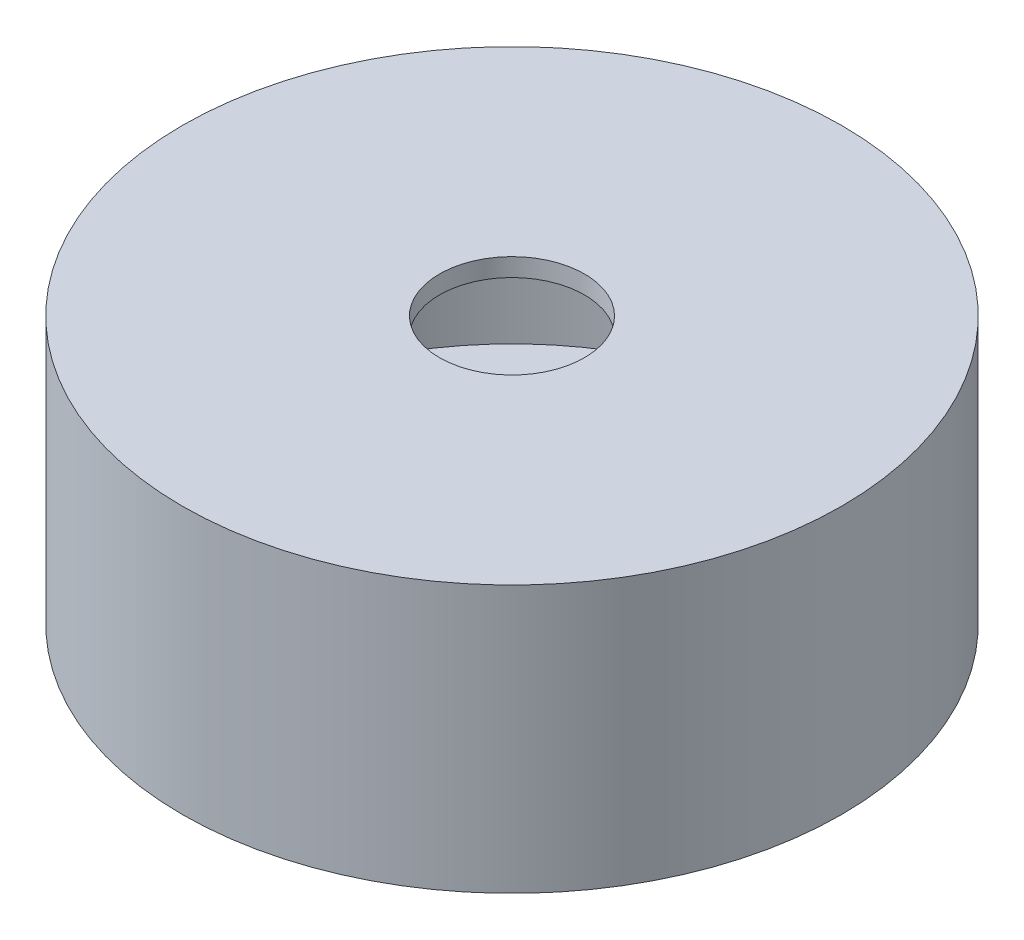
ISO-10303-21;
HEADER;
FILE_DESCRIPTION(('STEP AP214'),'2;1');
FILE_NAME('part.step','',(''),(''),'','','');
FILE_SCHEMA(('AUTOMOTIVE_DESIGN { 1 0 10303 214 1 1 1 1 }'));
ENDSEC;
DATA;
#1=APPLICATION_CONTEXT('core data for automotive mechanical design processes');
#2=APPLICATION_PROTOCOL_DEFINITION('international standard','automotive_design',2000,#1);
#3=PRODUCT_CONTEXT('',#1,'mechanical');
#4=PRODUCT('Part','Part','',(#3));
#5=PRODUCT_RELATED_PRODUCT_CATEGORY('part','',(#4));
#6=PRODUCT_DEFINITION_FORMATION('','',#4);
#7=PRODUCT_DEFINITION_CONTEXT('part definition',#1,'design');
#8=PRODUCT_DEFINITION('design','',#6,#7);
#9=PRODUCT_DEFINITION_SHAPE('','',#8);
#10=(LENGTH_UNIT() NAMED_UNIT(*) SI_UNIT(.MILLI.,.METRE.));
#11=(NAMED_UNIT(*) PLANE_ANGLE_UNIT() SI_UNIT($,.RADIAN.));
#12=(NAMED_UNIT(*) SI_UNIT($,.STERADIAN.) SOLID_ANGLE_UNIT());
#13=UNCERTAINTY_MEASURE_WITH_UNIT(LENGTH_MEASURE(1.E-05),#10,'distance_accuracy_value','');
#14=(GEOMETRIC_REPRESENTATION_CONTEXT(3) GLOBAL_UNCERTAINTY_ASSIGNED_CONTEXT((#13)) GLOBAL_UNIT_ASSIGNED_CONTEXT((#10,
#11,#12)) REPRESENTATION_CONTEXT('',''));
#15=CARTESIAN_POINT('',(0.,0.,0.));
#16=DIRECTION('',(0.,0.,1.));
#17=DIRECTION('',(1.,0.,0.));
#18=AXIS2_PLACEMENT_3D('',#15,#16,#17);
#19=CARTESIAN_POINT('',(50.,5.,0.));
#20=DIRECTION('',(-1.,0.,0.));
#21=DIRECTION('',(0.,0.,1.));
#22=AXIS2_PLACEMENT_3D('',#19,#20,#21);
#23=PLANE('',#22);
#24=DIRECTION('',(0.,0.,-1.));
#25=VECTOR('',#24,1.);
#26=CARTESIAN_POINT('',(50.,0.,0.));
#27=LINE('',#26,#25);
#28=CARTESIAN_POINT('',(50.,0.,-7.8));
#29=VERTEX_POINT('',#28);
#30=CARTESIAN_POINT('',(50.,0.,-32.2));
#31=VERTEX_POINT('',#30);
#32=EDGE_CURVE('E84',#29,#31,#27,.T.);
#33=ORIENTED_EDGE('',*,*,#32,.F.);
#34=DIRECTION('',(0.,-1.,0.));
#35=VECTOR('',#34,1.);
#36=CARTESIAN_POINT('',(50.,5.,-7.8));
#37=LINE('',#36,#35);
#38=CARTESIAN_POINT('',(50.,5.,-7.8));
#39=VERTEX_POINT('',#38);
#40=EDGE_CURVE('E11',#39,#29,#37,.T.);
#41=ORIENTED_EDGE('',*,*,#40,.F.);
#42=DIRECTION('',(0.,0.,-1.));
#43=VECTOR('',#42,1.);
#44=CARTESIAN_POINT('',(50.,5.,0.));
#45=LINE('',#44,#43);
#46=CARTESIAN_POINT('',(50.,5.,-32.2));
#47=VERTEX_POINT('',#46);
#48=EDGE_CURVE('E87',#39,#47,#45,.T.);
#49=ORIENTED_EDGE('',*,*,#48,.T.);
#50=DIRECTION('',(0.,-1.,0.));
#51=VECTOR('',#50,1.);
#52=CARTESIAN_POINT('',(50.,5.,-32.2));
#53=LINE('',#52,#51);
#54=EDGE_CURVE('E94',#47,#31,#53,.T.);
#55=ORIENTED_EDGE('',*,*,#54,.T.);
#56=EDGE_LOOP('',(#33,#41,#49,#55));
#57=FACE_BOUND('',#56,.T.);
#58=ADVANCED_FACE('F43',(#57),#23,.T.);
#59=CARTESIAN_POINT('',(0.,5.,-7.8));
#60=DIRECTION('',(0.,0.,-1.));
#61=DIRECTION('',(-1.,0.,0.));
#62=AXIS2_PLACEMENT_3D('',#59,#60,#61);
#63=PLANE('',#62);
#64=DIRECTION('',(1.,0.,0.));
#65=VECTOR('',#64,1.);
#66=CARTESIAN_POINT('',(0.,0.,-7.8));
#67=LINE('',#66,#65);
#68=CARTESIAN_POINT('',(5.,0.,-7.8));
#69=VERTEX_POINT('',#68);
#70=EDGE_CURVE('E98',#69,#29,#67,.T.);
#71=ORIENTED_EDGE('',*,*,#70,.F.);
#72=DIRECTION('',(0.,-1.,0.));
#73=VECTOR('',#72,1.);
#74=CARTESIAN_POINT('',(5.,5.,-7.8));
#75=LINE('',#74,#73);
#76=CARTESIAN_POINT('',(5.,5.,-7.8));
#77=VERTEX_POINT('',#76);
#78=EDGE_CURVE('E52',#77,#69,#75,.T.);
#79=ORIENTED_EDGE('',*,*,#78,.F.);
#80=DIRECTION('',(1.,0.,0.));
#81=VECTOR('',#80,1.);
#82=CARTESIAN_POINT('',(0.,5.,-7.8));
#83=LINE('',#82,#81);
#84=EDGE_CURVE('E108',#77,#39,#83,.T.);
#85=ORIENTED_EDGE('',*,*,#84,.T.);
#86=ORIENTED_EDGE('',*,*,#40,.T.);
#87=EDGE_LOOP('',(#71,#79,#85,#86));
#88=FACE_BOUND('',#87,.T.);
#89=ADVANCED_FACE('F136',(#88),#63,.T.);
#90=CARTESIAN_POINT('',(5.,5.,0.));
#91=DIRECTION('',(-1.,0.,0.));
#92=DIRECTION('',(0.,0.,1.));
#93=AXIS2_PLACEMENT_3D('',#90,#91,#92);
#94=PLANE('',#93);
#95=DIRECTION('',(0.,0.,-1.));
#96=VECTOR('',#95,1.);
#97=CARTESIAN_POINT('',(5.,0.,0.));
#98=LINE('',#97,#96);
#99=CARTESIAN_POINT('',(5.,0.,-32.2));
#100=VERTEX_POINT('',#99);
#101=EDGE_CURVE('E81',#69,#100,#98,.T.);
#102=ORIENTED_EDGE('',*,*,#101,.T.);
#103=DIRECTION('',(0.,-1.,0.));
#104=VECTOR('',#103,1.);
#105=CARTESIAN_POINT('',(5.,5.,-32.2));
#106=LINE('',#105,#104);
#107=CARTESIAN_POINT('',(5.,5.,-32.2));
#108=VERTEX_POINT('',#107);
#109=EDGE_CURVE('E90',#108,#100,#106,.T.);
#110=ORIENTED_EDGE('',*,*,#109,.F.);
#111=DIRECTION('',(0.,0.,-1.));
#112=VECTOR('',#111,1.);
#113=CARTESIAN_POINT('',(5.,5.,0.));
#114=LINE('',#113,#112);
#115=EDGE_CURVE('E59',#77,#108,#114,.T.);
#116=ORIENTED_EDGE('',*,*,#115,.F.);
#117=ORIENTED_EDGE('',*,*,#78,.T.);
#118=EDGE_LOOP('',(#102,#110,#116,#117));
#119=FACE_BOUND('',#118,.T.);
#120=ADVANCED_FACE('F96',(#119),#94,.F.);
#121=CARTESIAN_POINT('',(17.,5.,-20.));
#122=DIRECTION('',(0.,-1.,0.));
#123=DIRECTION('',(0.,0.,-1.));
#124=AXIS2_PLACEMENT_3D('',#121,#122,#123);
#125=CYLINDRICAL_SURFACE('',#124,50.);
#126=CARTESIAN_POINT('',(17.,0.,-20.));
#127=DIRECTION('',(0.,1.,0.));
#128=DIRECTION('',(0.,0.,1.));
#129=AXIS2_PLACEMENT_3D('',#126,#127,#128);
#130=CIRCLE('',#129,50.);
#131=CARTESIAN_POINT('',(17.,0.,30.));
#132=VERTEX_POINT('',#131);
#133=EDGE_CURVE('E112',#132,#132,#130,.T.);
#134=ORIENTED_EDGE('',*,*,#133,.T.);
#135=EDGE_LOOP('',(#134));
#136=FACE_BOUND('',#135,.T.);
#137=CARTESIAN_POINT('',(17.,40.5,-20.));
#138=DIRECTION('',(0.,1.,0.));
#139=DIRECTION('',(0.,0.,1.));
#140=AXIS2_PLACEMENT_3D('',#137,#138,#139);
#141=CIRCLE('',#140,50.);
#142=CARTESIAN_POINT('',(17.,40.5,30.));
#143=VERTEX_POINT('',#142);
#144=EDGE_CURVE('E214',#143,#143,#141,.T.);
#145=ORIENTED_EDGE('',*,*,#144,.F.);
#146=EDGE_LOOP('',(#145));
#147=FACE_BOUND('',#146,.T.);
#148=ADVANCED_FACE('F45',(#136,#147),#125,.T.);
#149=CARTESIAN_POINT('',(0.,5.,-32.2));
#150=DIRECTION('',(0.,0.,-1.));
#151=DIRECTION('',(-1.,0.,0.));
#152=AXIS2_PLACEMENT_3D('',#149,#150,#151);
#153=PLANE('',#152);
#154=DIRECTION('',(1.,0.,0.));
#155=VECTOR('',#154,1.);
#156=CARTESIAN_POINT('',(0.,0.,-32.2));
#157=LINE('',#156,#155);
#158=EDGE_CURVE('E76',#100,#31,#157,.T.);
#159=ORIENTED_EDGE('',*,*,#158,.T.);
#160=ORIENTED_EDGE('',*,*,#54,.F.);
#161=DIRECTION('',(1.,0.,0.));
#162=VECTOR('',#161,1.);
#163=CARTESIAN_POINT('',(0.,5.,-32.2));
#164=LINE('',#163,#162);
#165=EDGE_CURVE('E92',#108,#47,#164,.T.);
#166=ORIENTED_EDGE('',*,*,#165,.F.);
#167=ORIENTED_EDGE('',*,*,#109,.T.);
#168=EDGE_LOOP('',(#159,#160,#166,#167));
#169=FACE_BOUND('',#168,.T.);
#170=ADVANCED_FACE('F91',(#169),#153,.F.);
#171=CARTESIAN_POINT('',(0.,0.,0.));
#172=DIRECTION('',(0.,1.,0.));
#173=DIRECTION('',(0.,0.,1.));
#174=AXIS2_PLACEMENT_3D('',#171,#172,#173);
#175=PLANE('',#174);
#176=CARTESIAN_POINT('',(46.4999999999832,0.,-34.9999999999978));
#177=DIRECTION('',(0.,-1.,0.));
#178=DIRECTION('',(0.,0.,-1.));
#179=AXIS2_PLACEMENT_3D('',#176,#177,#178);
#180=CIRCLE('',#179,1.025);
#181=CARTESIAN_POINT('',(46.4999999999832,0.,-36.0249999999978));
#182=VERTEX_POINT('',#181);
#183=EDGE_CURVE('E118',#182,#182,#180,.T.);
#184=ORIENTED_EDGE('',*,*,#183,.F.);
#185=EDGE_LOOP('',(#184));
#186=FACE_BOUND('',#185,.T.);
#187=CARTESIAN_POINT('',(29.4999999999832,0.,-34.9999999999968));
#188=DIRECTION('',(0.,-1.,0.));
#189=DIRECTION('',(0.,0.,-1.));
#190=AXIS2_PLACEMENT_3D('',#187,#188,#189);
#191=CIRCLE('',#190,1.025);
#192=CARTESIAN_POINT('',(29.4999999999832,0.,-36.0249999999968));
#193=VERTEX_POINT('',#192);
#194=EDGE_CURVE('E123',#193,#193,#191,.T.);
#195=ORIENTED_EDGE('',*,*,#194,.F.);
#196=EDGE_LOOP('',(#195));
#197=FACE_BOUND('',#196,.T.);
#198=CARTESIAN_POINT('',(12.4999999999832,0.,-34.9999999999959));
#199=DIRECTION('',(0.,-1.,0.));
#200=DIRECTION('',(0.,0.,-1.));
#201=AXIS2_PLACEMENT_3D('',#198,#199,#200);
#202=CIRCLE('',#201,1.02499999999999);
#203=CARTESIAN_POINT('',(12.4999999999832,0.,-36.0249999999959));
#204=VERTEX_POINT('',#203);
#205=EDGE_CURVE('E248',#204,#204,#202,.T.);
#206=ORIENTED_EDGE('',*,*,#205,.F.);
#207=EDGE_LOOP('',(#206));
#208=FACE_BOUND('',#207,.T.);
#209=CARTESIAN_POINT('',(12.4999999999832,0.,-5.00000000000412));
#210=DIRECTION('',(0.,-1.,0.));
#211=DIRECTION('',(0.,0.,1.));
#212=AXIS2_PLACEMENT_3D('',#209,#210,#211);
#213=CIRCLE('',#212,1.02499999999999);
#214=CARTESIAN_POINT('',(12.4999999999832,0.,-3.97500000000413));
#215=VERTEX_POINT('',#214);
#216=EDGE_CURVE('E229',#215,#215,#213,.T.);
#217=ORIENTED_EDGE('',*,*,#216,.F.);
#218=EDGE_LOOP('',(#217));
#219=FACE_BOUND('',#218,.T.);
#220=CARTESIAN_POINT('',(29.4999999999832,0.,-5.00000000000318));
#221=DIRECTION('',(0.,-1.,0.));
#222=DIRECTION('',(0.,0.,1.));
#223=AXIS2_PLACEMENT_3D('',#220,#221,#222);
#224=CIRCLE('',#223,1.025);
#225=CARTESIAN_POINT('',(29.4999999999832,0.,-3.97500000000318));
#226=VERTEX_POINT('',#225);
#227=EDGE_CURVE('E226',#226,#226,#224,.T.);
#228=ORIENTED_EDGE('',*,*,#227,.F.);
#229=EDGE_LOOP('',(#228));
#230=FACE_BOUND('',#229,.T.);
#231=CARTESIAN_POINT('',(46.4999999999832,0.,-5.00000000000222));
#232=DIRECTION('',(0.,-1.,0.));
#233=DIRECTION('',(0.,0.,1.));
#234=AXIS2_PLACEMENT_3D('',#231,#232,#233);
#235=CIRCLE('',#234,1.025);
#236=CARTESIAN_POINT('',(46.4999999999832,0.,-3.97500000000222));
#237=VERTEX_POINT('',#236);
#238=EDGE_CURVE('E230',#237,#237,#235,.T.);
#239=ORIENTED_EDGE('',*,*,#238,.F.);
#240=EDGE_LOOP('',(#239));
#241=FACE_BOUND('',#240,.T.);
#242=CARTESIAN_POINT('',(52.7999999999835,0.,-11.5000000000019));
#243=DIRECTION('',(0.,-1.,0.));
#244=DIRECTION('',(0.,0.,1.));
#245=AXIS2_PLACEMENT_3D('',#242,#243,#244);
#246=CIRCLE('',#245,1.025);
#247=CARTESIAN_POINT('',(52.7999999999835,0.,-10.4750000000019));
#248=VERTEX_POINT('',#247);
#249=EDGE_CURVE('E132',#248,#248,#246,.T.);
#250=ORIENTED_EDGE('',*,*,#249,.F.);
#251=EDGE_LOOP('',(#250));
#252=FACE_BOUND('',#251,.T.);
#253=CARTESIAN_POINT('',(52.7999999999835,0.,-28.4999999999981));
#254=DIRECTION('',(0.,-1.,0.));
#255=DIRECTION('',(0.,0.,-1.));
#256=AXIS2_PLACEMENT_3D('',#253,#254,#255);
#257=CIRCLE('',#256,1.025);
#258=CARTESIAN_POINT('',(52.7999999999835,0.,-29.5249999999981));
#259=VERTEX_POINT('',#258);
#260=EDGE_CURVE('E114',#259,#259,#257,.T.);
#261=ORIENTED_EDGE('',*,*,#260,.F.);
#262=EDGE_LOOP('',(#261));
#263=FACE_BOUND('',#262,.T.);
#264=ORIENTED_EDGE('',*,*,#133,.F.);
#265=EDGE_LOOP('',(#264));
#266=FACE_BOUND('',#265,.T.);
#267=ORIENTED_EDGE('',*,*,#32,.T.);
#268=ORIENTED_EDGE('',*,*,#158,.F.);
#269=ORIENTED_EDGE('',*,*,#101,.F.);
#270=ORIENTED_EDGE('',*,*,#70,.T.);
#271=EDGE_LOOP('',(#267,#268,#269,#270));
#272=FACE_BOUND('',#271,.T.);
#273=ADVANCED_FACE('F78',(#186,#197,#208,#219,#230,#241,#252,#263,#266,#272),#175,.F.);
#274=CARTESIAN_POINT('',(52.7999999999835,5.001,-28.4999999999981));
#275=DIRECTION('',(0.,-1.,0.));
#276=DIRECTION('',(0.,0.,-1.));
#277=AXIS2_PLACEMENT_3D('',#274,#275,#276);
#278=CYLINDRICAL_SURFACE('',#277,1.025);
#279=CARTESIAN_POINT('',(52.7999999999835,5.,-28.4999999999981));
#280=DIRECTION('',(0.,1.,0.));
#281=DIRECTION('',(0.,0.,1.));
#282=AXIS2_PLACEMENT_3D('',#279,#280,#281);
#283=CIRCLE('',#282,1.025);
#284=CARTESIAN_POINT('',(52.7999999999835,5.,-27.4749999999981));
#285=VERTEX_POINT('',#284);
#286=EDGE_CURVE('E129',#285,#285,#283,.F.);
#287=ORIENTED_EDGE('',*,*,#286,.F.);
#288=EDGE_LOOP('',(#287));
#289=FACE_BOUND('',#288,.T.);
#290=ORIENTED_EDGE('',*,*,#260,.T.);
#291=EDGE_LOOP('',(#290));
#292=FACE_BOUND('',#291,.T.);
#293=ADVANCED_FACE('F154',(#289,#292),#278,.F.);
#294=CARTESIAN_POINT('',(52.7999999999835,5.001,-11.5000000000019));
#295=DIRECTION('',(0.,-1.,0.));
#296=DIRECTION('',(0.,0.,-1.));
#297=AXIS2_PLACEMENT_3D('',#294,#295,#296);
#298=CYLINDRICAL_SURFACE('',#297,1.025);
#299=CARTESIAN_POINT('',(52.7999999999835,5.,-11.5000000000019));
#300=DIRECTION('',(0.,1.,0.));
#301=DIRECTION('',(0.,0.,1.));
#302=AXIS2_PLACEMENT_3D('',#299,#300,#301);
#303=CIRCLE('',#302,1.025);
#304=CARTESIAN_POINT('',(52.7999999999835,5.,-10.4750000000019));
#305=VERTEX_POINT('',#304);
#306=EDGE_CURVE('E133',#305,#305,#303,.F.);
#307=ORIENTED_EDGE('',*,*,#306,.F.);
#308=EDGE_LOOP('',(#307));
#309=FACE_BOUND('',#308,.T.);
#310=ORIENTED_EDGE('',*,*,#249,.T.);
#311=EDGE_LOOP('',(#310));
#312=FACE_BOUND('',#311,.T.);
#313=ADVANCED_FACE('F158',(#309,#312),#298,.F.);
#314=CARTESIAN_POINT('',(46.4999999999832,5.001,-5.00000000000222));
#315=DIRECTION('',(0.,-1.,0.));
#316=DIRECTION('',(0.,0.,-1.));
#317=AXIS2_PLACEMENT_3D('',#314,#315,#316);
#318=CYLINDRICAL_SURFACE('',#317,1.025);
#319=CARTESIAN_POINT('',(46.4999999999832,5.,-5.00000000000222));
#320=DIRECTION('',(0.,1.,0.));
#321=DIRECTION('',(0.,0.,1.));
#322=AXIS2_PLACEMENT_3D('',#319,#320,#321);
#323=CIRCLE('',#322,1.025);
#324=CARTESIAN_POINT('',(46.4999999999832,5.,-3.97500000000222));
#325=VERTEX_POINT('',#324);
#326=EDGE_CURVE('E234',#325,#325,#323,.F.);
#327=ORIENTED_EDGE('',*,*,#326,.F.);
#328=EDGE_LOOP('',(#327));
#329=FACE_BOUND('',#328,.T.);
#330=ORIENTED_EDGE('',*,*,#238,.T.);
#331=EDGE_LOOP('',(#330));
#332=FACE_BOUND('',#331,.T.);
#333=ADVANCED_FACE('F179',(#329,#332),#318,.F.);
#334=CARTESIAN_POINT('',(29.4999999999832,5.001,-5.00000000000318));
#335=DIRECTION('',(0.,-1.,0.));
#336=DIRECTION('',(0.,0.,-1.));
#337=AXIS2_PLACEMENT_3D('',#334,#335,#336);
#338=CYLINDRICAL_SURFACE('',#337,1.025);
#339=CARTESIAN_POINT('',(29.4999999999832,5.,-5.00000000000318));
#340=DIRECTION('',(0.,1.,0.));
#341=DIRECTION('',(0.,0.,1.));
#342=AXIS2_PLACEMENT_3D('',#339,#340,#341);
#343=CIRCLE('',#342,1.025);
#344=CARTESIAN_POINT('',(29.4999999999832,5.,-3.97500000000318));
#345=VERTEX_POINT('',#344);
#346=EDGE_CURVE('E231',#345,#345,#343,.F.);
#347=ORIENTED_EDGE('',*,*,#346,.F.);
#348=EDGE_LOOP('',(#347));
#349=FACE_BOUND('',#348,.T.);
#350=ORIENTED_EDGE('',*,*,#227,.T.);
#351=EDGE_LOOP('',(#350));
#352=FACE_BOUND('',#351,.T.);
#353=ADVANCED_FACE('F164',(#349,#352),#338,.F.);
#354=CARTESIAN_POINT('',(12.4999999999832,5.001,-5.00000000000412));
#355=DIRECTION('',(0.,-1.,0.));
#356=DIRECTION('',(0.,0.,-1.));
#357=AXIS2_PLACEMENT_3D('',#354,#355,#356);
#358=CYLINDRICAL_SURFACE('',#357,1.02499999999999);
#359=CARTESIAN_POINT('',(12.4999999999832,5.,-5.00000000000412));
#360=DIRECTION('',(0.,1.,0.));
#361=DIRECTION('',(0.,0.,1.));
#362=AXIS2_PLACEMENT_3D('',#359,#360,#361);
#363=CIRCLE('',#362,1.02499999999999);
#364=CARTESIAN_POINT('',(12.4999999999832,5.,-3.97500000000413));
#365=VERTEX_POINT('',#364);
#366=EDGE_CURVE('E127',#365,#365,#363,.F.);
#367=ORIENTED_EDGE('',*,*,#366,.F.);
#368=EDGE_LOOP('',(#367));
#369=FACE_BOUND('',#368,.T.);
#370=ORIENTED_EDGE('',*,*,#216,.T.);
#371=EDGE_LOOP('',(#370));
#372=FACE_BOUND('',#371,.T.);
#373=ADVANCED_FACE('F160',(#369,#372),#358,.F.);
#374=CARTESIAN_POINT('',(12.4999999999832,5.001,-34.9999999999959));
#375=DIRECTION('',(0.,-1.,0.));
#376=DIRECTION('',(0.,0.,-1.));
#377=AXIS2_PLACEMENT_3D('',#374,#375,#376);
#378=CYLINDRICAL_SURFACE('',#377,1.02499999999999);
#379=CARTESIAN_POINT('',(12.4999999999832,5.,-34.9999999999959));
#380=DIRECTION('',(0.,1.,0.));
#381=DIRECTION('',(0.,0.,1.));
#382=AXIS2_PLACEMENT_3D('',#379,#380,#381);
#383=CIRCLE('',#382,1.02499999999999);
#384=CARTESIAN_POINT('',(12.4999999999832,5.,-33.9749999999959));
#385=VERTEX_POINT('',#384);
#386=EDGE_CURVE('E251',#385,#385,#383,.F.);
#387=ORIENTED_EDGE('',*,*,#386,.F.);
#388=EDGE_LOOP('',(#387));
#389=FACE_BOUND('',#388,.T.);
#390=ORIENTED_EDGE('',*,*,#205,.T.);
#391=EDGE_LOOP('',(#390));
#392=FACE_BOUND('',#391,.T.);
#393=ADVANCED_FACE('F163',(#389,#392),#378,.F.);
#394=CARTESIAN_POINT('',(29.4999999999832,5.001,-34.9999999999968));
#395=DIRECTION('',(0.,-1.,0.));
#396=DIRECTION('',(0.,0.,-1.));
#397=AXIS2_PLACEMENT_3D('',#394,#395,#396);
#398=CYLINDRICAL_SURFACE('',#397,1.025);
#399=CARTESIAN_POINT('',(29.4999999999832,5.,-34.9999999999968));
#400=DIRECTION('',(0.,1.,0.));
#401=DIRECTION('',(0.,0.,1.));
#402=AXIS2_PLACEMENT_3D('',#399,#400,#401);
#403=CIRCLE('',#402,1.025);
#404=CARTESIAN_POINT('',(29.4999999999832,5.,-33.9749999999968));
#405=VERTEX_POINT('',#404);
#406=EDGE_CURVE('E245',#405,#405,#403,.F.);
#407=ORIENTED_EDGE('',*,*,#406,.F.);
#408=EDGE_LOOP('',(#407));
#409=FACE_BOUND('',#408,.T.);
#410=ORIENTED_EDGE('',*,*,#194,.T.);
#411=EDGE_LOOP('',(#410));
#412=FACE_BOUND('',#411,.T.);
#413=ADVANCED_FACE('F168',(#409,#412),#398,.F.);
#414=CARTESIAN_POINT('',(46.4999999999832,5.001,-34.9999999999978));
#415=DIRECTION('',(0.,-1.,0.));
#416=DIRECTION('',(0.,0.,-1.));
#417=AXIS2_PLACEMENT_3D('',#414,#415,#416);
#418=CYLINDRICAL_SURFACE('',#417,1.025);
#419=CARTESIAN_POINT('',(46.4999999999832,5.,-34.9999999999978));
#420=DIRECTION('',(0.,1.,0.));
#421=DIRECTION('',(0.,0.,1.));
#422=AXIS2_PLACEMENT_3D('',#419,#420,#421);
#423=CIRCLE('',#422,1.025);
#424=CARTESIAN_POINT('',(46.4999999999832,5.,-33.9749999999978));
#425=VERTEX_POINT('',#424);
#426=EDGE_CURVE('E223',#425,#425,#423,.F.);
#427=ORIENTED_EDGE('',*,*,#426,.F.);
#428=EDGE_LOOP('',(#427));
#429=FACE_BOUND('',#428,.T.);
#430=ORIENTED_EDGE('',*,*,#183,.T.);
#431=EDGE_LOOP('',(#430));
#432=FACE_BOUND('',#431,.T.);
#433=ADVANCED_FACE('F172',(#429,#432),#418,.F.);
#434=CARTESIAN_POINT('',(17.,5.,-20.));
#435=DIRECTION('',(0.,1.,0.));
#436=DIRECTION('',(0.,0.,1.));
#437=AXIS2_PLACEMENT_3D('',#434,#435,#436);
#438=PLANE('',#437);
#439=ORIENTED_EDGE('',*,*,#84,.F.);
#440=ORIENTED_EDGE('',*,*,#115,.T.);
#441=ORIENTED_EDGE('',*,*,#165,.T.);
#442=ORIENTED_EDGE('',*,*,#48,.F.);
#443=EDGE_LOOP('',(#439,#440,#441,#442));
#444=FACE_BOUND('',#443,.T.);
#445=CARTESIAN_POINT('',(17.,5.,-20.));
#446=DIRECTION('',(0.,1.,0.));
#447=DIRECTION('',(0.,0.,1.));
#448=AXIS2_PLACEMENT_3D('',#445,#446,#447);
#449=CIRCLE('',#448,45.);
#450=CARTESIAN_POINT('',(17.,5.,25.));
#451=VERTEX_POINT('',#450);
#452=EDGE_CURVE('E220',#451,#451,#449,.T.);
#453=ORIENTED_EDGE('',*,*,#452,.T.);
#454=EDGE_LOOP('',(#453));
#455=FACE_BOUND('',#454,.T.);
#456=ORIENTED_EDGE('',*,*,#426,.T.);
#457=EDGE_LOOP('',(#456));
#458=FACE_BOUND('',#457,.T.);
#459=ORIENTED_EDGE('',*,*,#406,.T.);
#460=EDGE_LOOP('',(#459));
#461=FACE_BOUND('',#460,.T.);
#462=ORIENTED_EDGE('',*,*,#386,.T.);
#463=EDGE_LOOP('',(#462));
#464=FACE_BOUND('',#463,.T.);
#465=ORIENTED_EDGE('',*,*,#366,.T.);
#466=EDGE_LOOP('',(#465));
#467=FACE_BOUND('',#466,.T.);
#468=ORIENTED_EDGE('',*,*,#346,.T.);
#469=EDGE_LOOP('',(#468));
#470=FACE_BOUND('',#469,.T.);
#471=ORIENTED_EDGE('',*,*,#326,.T.);
#472=EDGE_LOOP('',(#471));
#473=FACE_BOUND('',#472,.T.);
#474=ORIENTED_EDGE('',*,*,#306,.T.);
#475=EDGE_LOOP('',(#474));
#476=FACE_BOUND('',#475,.T.);
#477=ORIENTED_EDGE('',*,*,#286,.T.);
#478=EDGE_LOOP('',(#477));
#479=FACE_BOUND('',#478,.T.);
#480=ADVANCED_FACE('F139',(#444,#455,#458,#461,#464,#467,#470,#473,#476,#479),#438,.T.);
#481=CARTESIAN_POINT('',(17.,5.,-20.));
#482=DIRECTION('',(0.,1.,0.));
#483=DIRECTION('',(0.,0.,1.));
#484=AXIS2_PLACEMENT_3D('',#481,#482,#483);
#485=CYLINDRICAL_SURFACE('',#484,45.);
#486=ORIENTED_EDGE('',*,*,#452,.F.);
#487=EDGE_LOOP('',(#486));
#488=FACE_BOUND('',#487,.T.);
#489=CARTESIAN_POINT('',(17.,37.75,-20.));
#490=DIRECTION('',(0.,1.,0.));
#491=DIRECTION('',(0.,0.,1.));
#492=AXIS2_PLACEMENT_3D('',#489,#490,#491);
#493=CIRCLE('',#492,45.);
#494=CARTESIAN_POINT('',(17.,37.75,25.));
#495=VERTEX_POINT('',#494);
#496=EDGE_CURVE('E219',#495,#495,#493,.T.);
#497=ORIENTED_EDGE('',*,*,#496,.T.);
#498=EDGE_LOOP('',(#497));
#499=FACE_BOUND('',#498,.T.);
#500=ADVANCED_FACE('F187',(#488,#499),#485,.F.);
#501=CARTESIAN_POINT('',(17.,37.75,-20.));
#502=DIRECTION('',(0.,1.,0.));
#503=DIRECTION('',(0.,0.,1.));
#504=AXIS2_PLACEMENT_3D('',#501,#502,#503);
#505=PLANE('',#504);
#506=CARTESIAN_POINT('',(17.,37.75,-20.));
#507=DIRECTION('',(0.,1.,0.));
#508=DIRECTION('',(0.,0.,1.));
#509=AXIS2_PLACEMENT_3D('',#506,#507,#508);
#510=CIRCLE('',#509,11.);
#511=CARTESIAN_POINT('',(17.,37.75,-9.00000000000001));
#512=VERTEX_POINT('',#511);
#513=EDGE_CURVE('E209',#512,#512,#510,.T.);
#514=ORIENTED_EDGE('',*,*,#513,.T.);
#515=EDGE_LOOP('',(#514));
#516=FACE_BOUND('',#515,.T.);
#517=ORIENTED_EDGE('',*,*,#496,.F.);
#518=EDGE_LOOP('',(#517));
#519=FACE_BOUND('',#518,.T.);
#520=ADVANCED_FACE('F190',(#516,#519),#505,.F.);
#521=CARTESIAN_POINT('',(17.,40.5,-20.));
#522=DIRECTION('',(0.,1.,0.));
#523=DIRECTION('',(0.,0.,1.));
#524=AXIS2_PLACEMENT_3D('',#521,#522,#523);
#525=PLANE('',#524);
#526=CARTESIAN_POINT('',(17.,40.5,-20.));
#527=DIRECTION('',(0.,1.,0.));
#528=DIRECTION('',(0.,0.,1.));
#529=AXIS2_PLACEMENT_3D('',#526,#527,#528);
#530=CIRCLE('',#529,11.);
#531=CARTESIAN_POINT('',(17.,40.5,-9.00000000000001));
#532=VERTEX_POINT('',#531);
#533=EDGE_CURVE('E212',#532,#532,#530,.T.);
#534=ORIENTED_EDGE('',*,*,#533,.F.);
#535=EDGE_LOOP('',(#534));
#536=FACE_BOUND('',#535,.T.);
#537=ORIENTED_EDGE('',*,*,#144,.T.);
#538=EDGE_LOOP('',(#537));
#539=FACE_BOUND('',#538,.T.);
#540=ADVANCED_FACE('F196',(#536,#539),#525,.T.);
#541=CARTESIAN_POINT('',(17.,37.75,-20.));
#542=DIRECTION('',(0.,1.,0.));
#543=DIRECTION('',(0.,0.,1.));
#544=AXIS2_PLACEMENT_3D('',#541,#542,#543);
#545=CYLINDRICAL_SURFACE('',#544,11.);
#546=ORIENTED_EDGE('',*,*,#513,.F.);
#547=EDGE_LOOP('',(#546));
#548=FACE_BOUND('',#547,.T.);
#549=ORIENTED_EDGE('',*,*,#533,.T.);
#550=EDGE_LOOP('',(#549));
#551=FACE_BOUND('',#550,.T.);
#552=ADVANCED_FACE('F200',(#548,#551),#545,.F.);
#553=CLOSED_SHELL('',(#58,#89,#120,#148,#170,#273,#293,#313,#333,#353,#373,#393,#413,#433,#480,
#500,#520,#540,#552));
#554=MANIFOLD_SOLID_BREP('B2',#553);
#555=ADVANCED_BREP_SHAPE_REPRESENTATION('',(#18,#554),#14);
#556=SHAPE_DEFINITION_REPRESENTATION(#9,#555);
ENDSEC;
END-ISO-10303-21;
